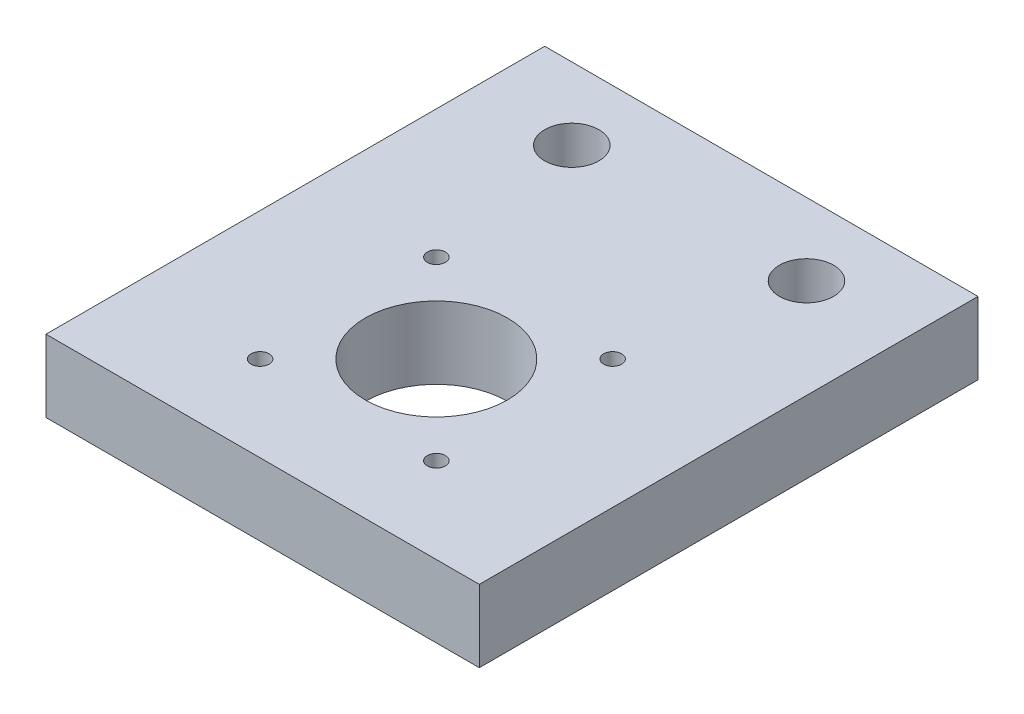
ISO-10303-21;
HEADER;
FILE_DESCRIPTION(('STEP AP214'),'2;1');
FILE_NAME('part.step','',(''),(''),'','','');
FILE_SCHEMA(('AUTOMOTIVE_DESIGN { 1 0 10303 214 1 1 1 1 }'));
ENDSEC;
DATA;
#1=APPLICATION_CONTEXT('core data for automotive mechanical design processes');
#2=APPLICATION_PROTOCOL_DEFINITION('international standard','automotive_design',2000,#1);
#3=PRODUCT_CONTEXT('',#1,'mechanical');
#4=PRODUCT('Part','Part','',(#3));
#5=PRODUCT_RELATED_PRODUCT_CATEGORY('part','',(#4));
#6=PRODUCT_DEFINITION_FORMATION('','',#4);
#7=PRODUCT_DEFINITION_CONTEXT('part definition',#1,'design');
#8=PRODUCT_DEFINITION('design','',#6,#7);
#9=PRODUCT_DEFINITION_SHAPE('','',#8);
#10=(LENGTH_UNIT() NAMED_UNIT(*) SI_UNIT(.MILLI.,.METRE.));
#11=(NAMED_UNIT(*) PLANE_ANGLE_UNIT() SI_UNIT($,.RADIAN.));
#12=(NAMED_UNIT(*) SI_UNIT($,.STERADIAN.) SOLID_ANGLE_UNIT());
#13=UNCERTAINTY_MEASURE_WITH_UNIT(LENGTH_MEASURE(1.E-05),#10,'distance_accuracy_value','');
#14=(GEOMETRIC_REPRESENTATION_CONTEXT(3) GLOBAL_UNCERTAINTY_ASSIGNED_CONTEXT((#13)) GLOBAL_UNIT_ASSIGNED_CONTEXT((#10,
#11,#12)) REPRESENTATION_CONTEXT('',''));
#15=CARTESIAN_POINT('',(0.,0.,0.));
#16=DIRECTION('',(0.,0.,1.));
#17=DIRECTION('',(1.,0.,0.));
#18=AXIS2_PLACEMENT_3D('',#15,#16,#17);
#19=CARTESIAN_POINT('',(-17.4625,12.7,-12.7));
#20=DIRECTION('',(0.,-1.,0.));
#21=DIRECTION('',(0.,0.,-1.));
#22=AXIS2_PLACEMENT_3D('',#19,#20,#21);
#23=PLANE('',#22);
#24=CARTESIAN_POINT('',(5.13750000000033,12.7,59.9500000000002));
#25=DIRECTION('',(0.,1.,0.));
#26=DIRECTION('',(0.,0.,1.));
#27=AXIS2_PLACEMENT_3D('',#24,#25,#26);
#28=CIRCLE('',#27,1.5875);
#29=CARTESIAN_POINT('',(5.13750000000033,12.7,61.5375000000002));
#30=VERTEX_POINT('',#29);
#31=EDGE_CURVE('E146',#30,#30,#28,.T.);
#32=ORIENTED_EDGE('',*,*,#31,.F.);
#33=EDGE_LOOP('',(#32));
#34=FACE_BOUND('',#33,.T.);
#35=CARTESIAN_POINT('',(36.1375000000003,12.7,59.95));
#36=DIRECTION('',(0.,1.,0.));
#37=DIRECTION('',(0.,0.,1.));
#38=AXIS2_PLACEMENT_3D('',#35,#36,#37);
#39=CIRCLE('',#38,1.5875);
#40=CARTESIAN_POINT('',(36.1375000000003,12.7,61.5375));
#41=VERTEX_POINT('',#40);
#42=EDGE_CURVE('E140',#41,#41,#39,.T.);
#43=ORIENTED_EDGE('',*,*,#42,.F.);
#44=EDGE_LOOP('',(#43));
#45=FACE_BOUND('',#44,.T.);
#46=CARTESIAN_POINT('',(5.1375,12.7,28.9500000000002));
#47=DIRECTION('',(0.,1.,0.));
#48=DIRECTION('',(0.,0.,1.));
#49=AXIS2_PLACEMENT_3D('',#46,#47,#48);
#50=CIRCLE('',#49,1.5875);
#51=CARTESIAN_POINT('',(5.1375,12.7,30.5375000000002));
#52=VERTEX_POINT('',#51);
#53=EDGE_CURVE('E134',#52,#52,#50,.T.);
#54=ORIENTED_EDGE('',*,*,#53,.F.);
#55=EDGE_LOOP('',(#54));
#56=FACE_BOUND('',#55,.T.);
#57=CARTESIAN_POINT('',(36.1375,12.7,28.95));
#58=DIRECTION('',(0.,1.,0.));
#59=DIRECTION('',(0.,0.,1.));
#60=AXIS2_PLACEMENT_3D('',#57,#58,#59);
#61=CIRCLE('',#60,1.5875);
#62=CARTESIAN_POINT('',(36.1375,12.7,30.5375));
#63=VERTEX_POINT('',#62);
#64=EDGE_CURVE('E128',#63,#63,#61,.T.);
#65=ORIENTED_EDGE('',*,*,#64,.F.);
#66=EDGE_LOOP('',(#65));
#67=FACE_BOUND('',#66,.T.);
#68=CARTESIAN_POINT('',(20.6375,12.7,44.45));
#69=DIRECTION('',(0.,1.,0.));
#70=DIRECTION('',(0.,0.,1.));
#71=AXIS2_PLACEMENT_3D('',#68,#69,#70);
#72=CIRCLE('',#71,12.5);
#73=CARTESIAN_POINT('',(20.6375,12.7,56.95));
#74=VERTEX_POINT('',#73);
#75=EDGE_CURVE('E122',#74,#74,#72,.T.);
#76=ORIENTED_EDGE('',*,*,#75,.F.);
#77=EDGE_LOOP('',(#76));
#78=FACE_BOUND('',#77,.T.);
#79=CARTESIAN_POINT('',(0.,12.7,0.));
#80=DIRECTION('',(0.,1.,0.));
#81=DIRECTION('',(0.,0.,1.));
#82=AXIS2_PLACEMENT_3D('',#79,#80,#81);
#83=CIRCLE('',#82,4.7625);
#84=CARTESIAN_POINT('',(0.,12.7,4.7625));
#85=VERTEX_POINT('',#84);
#86=EDGE_CURVE('E98',#85,#85,#83,.T.);
#87=ORIENTED_EDGE('',*,*,#86,.F.);
#88=EDGE_LOOP('',(#87));
#89=FACE_BOUND('',#88,.T.);
#90=DIRECTION('',(0.,0.,1.));
#91=VECTOR('',#90,1.);
#92=CARTESIAN_POINT('',(-17.4625,12.7,75.));
#93=LINE('',#92,#91);
#94=CARTESIAN_POINT('',(-17.4625,12.7,-12.7));
#95=VERTEX_POINT('',#94);
#96=CARTESIAN_POINT('',(-17.4625,12.7,75.));
#97=VERTEX_POINT('',#96);
#98=EDGE_CURVE('E83',#95,#97,#93,.T.);
#99=ORIENTED_EDGE('',*,*,#98,.T.);
#100=DIRECTION('',(1.,0.,0.));
#101=VECTOR('',#100,1.);
#102=CARTESIAN_POINT('',(58.7375,12.7,75.));
#103=LINE('',#102,#101);
#104=CARTESIAN_POINT('',(58.7375,12.7,75.));
#105=VERTEX_POINT('',#104);
#106=EDGE_CURVE('E78',#97,#105,#103,.T.);
#107=ORIENTED_EDGE('',*,*,#106,.T.);
#108=DIRECTION('',(0.,0.,-1.));
#109=VECTOR('',#108,1.);
#110=CARTESIAN_POINT('',(58.7375,12.7,-12.7));
#111=LINE('',#110,#109);
#112=CARTESIAN_POINT('',(58.7375,12.7,-12.7));
#113=VERTEX_POINT('',#112);
#114=EDGE_CURVE('E81',#105,#113,#111,.T.);
#115=ORIENTED_EDGE('',*,*,#114,.T.);
#116=DIRECTION('',(-1.,0.,0.));
#117=VECTOR('',#116,1.);
#118=CARTESIAN_POINT('',(-17.4625,12.7,-12.7));
#119=LINE('',#118,#117);
#120=EDGE_CURVE('E48',#113,#95,#119,.T.);
#121=ORIENTED_EDGE('',*,*,#120,.T.);
#122=EDGE_LOOP('',(#99,#107,#115,#121));
#123=FACE_BOUND('',#122,.T.);
#124=CARTESIAN_POINT('',(41.275,12.7,0.));
#125=DIRECTION('',(0.,1.,0.));
#126=DIRECTION('',(0.,0.,1.));
#127=AXIS2_PLACEMENT_3D('',#124,#125,#126);
#128=CIRCLE('',#127,4.7625);
#129=CARTESIAN_POINT('',(41.275,12.7,4.7625));
#130=VERTEX_POINT('',#129);
#131=EDGE_CURVE('E113',#130,#130,#128,.T.);
#132=ORIENTED_EDGE('',*,*,#131,.F.);
#133=EDGE_LOOP('',(#132));
#134=FACE_BOUND('',#133,.T.);
#135=ADVANCED_FACE('F31',(#34,#45,#56,#67,#78,#89,#123,#134),#23,.F.);
#136=CARTESIAN_POINT('',(-17.4625,0.,-12.7));
#137=DIRECTION('',(0.,-1.,0.));
#138=DIRECTION('',(0.,0.,-1.));
#139=AXIS2_PLACEMENT_3D('',#136,#137,#138);
#140=PLANE('',#139);
#141=CARTESIAN_POINT('',(5.13750000000033,0.,59.9500000000002));
#142=DIRECTION('',(0.,1.,0.));
#143=DIRECTION('',(0.,0.,1.));
#144=AXIS2_PLACEMENT_3D('',#141,#142,#143);
#145=CIRCLE('',#144,1.5875);
#146=CARTESIAN_POINT('',(5.13750000000033,0.,61.5375000000002));
#147=VERTEX_POINT('',#146);
#148=EDGE_CURVE('E143',#147,#147,#145,.T.);
#149=ORIENTED_EDGE('',*,*,#148,.T.);
#150=EDGE_LOOP('',(#149));
#151=FACE_BOUND('',#150,.T.);
#152=CARTESIAN_POINT('',(36.1375000000003,0.,59.95));
#153=DIRECTION('',(0.,1.,0.));
#154=DIRECTION('',(0.,0.,1.));
#155=AXIS2_PLACEMENT_3D('',#152,#153,#154);
#156=CIRCLE('',#155,1.5875);
#157=CARTESIAN_POINT('',(36.1375000000003,0.,61.5375));
#158=VERTEX_POINT('',#157);
#159=EDGE_CURVE('E137',#158,#158,#156,.T.);
#160=ORIENTED_EDGE('',*,*,#159,.T.);
#161=EDGE_LOOP('',(#160));
#162=FACE_BOUND('',#161,.T.);
#163=CARTESIAN_POINT('',(5.1375,0.,28.9500000000002));
#164=DIRECTION('',(0.,1.,0.));
#165=DIRECTION('',(0.,0.,1.));
#166=AXIS2_PLACEMENT_3D('',#163,#164,#165);
#167=CIRCLE('',#166,1.5875);
#168=CARTESIAN_POINT('',(5.1375,0.,30.5375000000002));
#169=VERTEX_POINT('',#168);
#170=EDGE_CURVE('E131',#169,#169,#167,.T.);
#171=ORIENTED_EDGE('',*,*,#170,.T.);
#172=EDGE_LOOP('',(#171));
#173=FACE_BOUND('',#172,.T.);
#174=CARTESIAN_POINT('',(36.1375,0.,28.95));
#175=DIRECTION('',(0.,1.,0.));
#176=DIRECTION('',(0.,0.,1.));
#177=AXIS2_PLACEMENT_3D('',#174,#175,#176);
#178=CIRCLE('',#177,1.5875);
#179=CARTESIAN_POINT('',(36.1375,0.,30.5375));
#180=VERTEX_POINT('',#179);
#181=EDGE_CURVE('E125',#180,#180,#178,.T.);
#182=ORIENTED_EDGE('',*,*,#181,.T.);
#183=EDGE_LOOP('',(#182));
#184=FACE_BOUND('',#183,.T.);
#185=CARTESIAN_POINT('',(20.6375,0.,44.45));
#186=DIRECTION('',(0.,1.,0.));
#187=DIRECTION('',(0.,0.,1.));
#188=AXIS2_PLACEMENT_3D('',#185,#186,#187);
#189=CIRCLE('',#188,12.5);
#190=CARTESIAN_POINT('',(20.6375,0.,56.95));
#191=VERTEX_POINT('',#190);
#192=EDGE_CURVE('E119',#191,#191,#189,.T.);
#193=ORIENTED_EDGE('',*,*,#192,.T.);
#194=EDGE_LOOP('',(#193));
#195=FACE_BOUND('',#194,.T.);
#196=CARTESIAN_POINT('',(0.,0.,0.));
#197=DIRECTION('',(0.,1.,0.));
#198=DIRECTION('',(0.,0.,1.));
#199=AXIS2_PLACEMENT_3D('',#196,#197,#198);
#200=CIRCLE('',#199,4.7625);
#201=CARTESIAN_POINT('',(0.,0.,4.7625));
#202=VERTEX_POINT('',#201);
#203=EDGE_CURVE('E110',#202,#202,#200,.T.);
#204=ORIENTED_EDGE('',*,*,#203,.T.);
#205=EDGE_LOOP('',(#204));
#206=FACE_BOUND('',#205,.T.);
#207=DIRECTION('',(0.,0.,1.));
#208=VECTOR('',#207,1.);
#209=CARTESIAN_POINT('',(-17.4625,0.,75.));
#210=LINE('',#209,#208);
#211=CARTESIAN_POINT('',(-17.4625,0.,-12.7));
#212=VERTEX_POINT('',#211);
#213=CARTESIAN_POINT('',(-17.4625,0.,75.));
#214=VERTEX_POINT('',#213);
#215=EDGE_CURVE('E95',#212,#214,#210,.T.);
#216=ORIENTED_EDGE('',*,*,#215,.F.);
#217=DIRECTION('',(-1.,0.,0.));
#218=VECTOR('',#217,1.);
#219=CARTESIAN_POINT('',(-17.4625,0.,-12.7));
#220=LINE('',#219,#218);
#221=CARTESIAN_POINT('',(58.7375,0.,-12.7));
#222=VERTEX_POINT('',#221);
#223=EDGE_CURVE('E71',#222,#212,#220,.T.);
#224=ORIENTED_EDGE('',*,*,#223,.F.);
#225=DIRECTION('',(0.,0.,-1.));
#226=VECTOR('',#225,1.);
#227=CARTESIAN_POINT('',(58.7375,0.,-12.7));
#228=LINE('',#227,#226);
#229=CARTESIAN_POINT('',(58.7375,0.,75.));
#230=VERTEX_POINT('',#229);
#231=EDGE_CURVE('E65',#230,#222,#228,.T.);
#232=ORIENTED_EDGE('',*,*,#231,.F.);
#233=DIRECTION('',(1.,0.,0.));
#234=VECTOR('',#233,1.);
#235=CARTESIAN_POINT('',(58.7375,0.,75.));
#236=LINE('',#235,#234);
#237=EDGE_CURVE('E87',#214,#230,#236,.T.);
#238=ORIENTED_EDGE('',*,*,#237,.F.);
#239=EDGE_LOOP('',(#216,#224,#232,#238));
#240=FACE_BOUND('',#239,.T.);
#241=CARTESIAN_POINT('',(41.275,0.,0.));
#242=DIRECTION('',(0.,1.,0.));
#243=DIRECTION('',(0.,0.,1.));
#244=AXIS2_PLACEMENT_3D('',#241,#242,#243);
#245=CIRCLE('',#244,4.7625);
#246=CARTESIAN_POINT('',(41.275,0.,4.7625));
#247=VERTEX_POINT('',#246);
#248=EDGE_CURVE('E116',#247,#247,#245,.T.);
#249=ORIENTED_EDGE('',*,*,#248,.T.);
#250=EDGE_LOOP('',(#249));
#251=FACE_BOUND('',#250,.T.);
#252=ADVANCED_FACE('F106',(#151,#162,#173,#184,#195,#206,#240,#251),#140,.T.);
#253=CARTESIAN_POINT('',(-17.4625,12.7,75.));
#254=DIRECTION('',(1.,0.,0.));
#255=DIRECTION('',(0.,0.,-1.));
#256=AXIS2_PLACEMENT_3D('',#253,#254,#255);
#257=PLANE('',#256);
#258=ORIENTED_EDGE('',*,*,#215,.T.);
#259=DIRECTION('',(0.,-1.,0.));
#260=VECTOR('',#259,1.);
#261=CARTESIAN_POINT('',(-17.4625,12.7,75.));
#262=LINE('',#261,#260);
#263=EDGE_CURVE('E11',#97,#214,#262,.T.);
#264=ORIENTED_EDGE('',*,*,#263,.F.);
#265=ORIENTED_EDGE('',*,*,#98,.F.);
#266=DIRECTION('',(0.,-1.,0.));
#267=VECTOR('',#266,1.);
#268=CARTESIAN_POINT('',(-17.4625,12.7,-12.7));
#269=LINE('',#268,#267);
#270=EDGE_CURVE('E91',#95,#212,#269,.T.);
#271=ORIENTED_EDGE('',*,*,#270,.T.);
#272=EDGE_LOOP('',(#258,#264,#265,#271));
#273=FACE_BOUND('',#272,.T.);
#274=ADVANCED_FACE('F33',(#273),#257,.F.);
#275=CARTESIAN_POINT('',(58.7375,12.7,75.));
#276=DIRECTION('',(0.,0.,-1.));
#277=DIRECTION('',(-1.,0.,0.));
#278=AXIS2_PLACEMENT_3D('',#275,#276,#277);
#279=PLANE('',#278);
#280=ORIENTED_EDGE('',*,*,#237,.T.);
#281=DIRECTION('',(0.,-1.,0.));
#282=VECTOR('',#281,1.);
#283=CARTESIAN_POINT('',(58.7375,12.7,75.));
#284=LINE('',#283,#282);
#285=EDGE_CURVE('E40',#105,#230,#284,.T.);
#286=ORIENTED_EDGE('',*,*,#285,.F.);
#287=ORIENTED_EDGE('',*,*,#106,.F.);
#288=ORIENTED_EDGE('',*,*,#263,.T.);
#289=EDGE_LOOP('',(#280,#286,#287,#288));
#290=FACE_BOUND('',#289,.T.);
#291=ADVANCED_FACE('F86',(#290),#279,.F.);
#292=CARTESIAN_POINT('',(58.7375,12.7,-12.7));
#293=DIRECTION('',(-1.,0.,0.));
#294=DIRECTION('',(0.,0.,1.));
#295=AXIS2_PLACEMENT_3D('',#292,#293,#294);
#296=PLANE('',#295);
#297=ORIENTED_EDGE('',*,*,#231,.T.);
#298=DIRECTION('',(0.,-1.,0.));
#299=VECTOR('',#298,1.);
#300=CARTESIAN_POINT('',(58.7375,12.7,-12.7));
#301=LINE('',#300,#299);
#302=EDGE_CURVE('E88',#113,#222,#301,.T.);
#303=ORIENTED_EDGE('',*,*,#302,.F.);
#304=ORIENTED_EDGE('',*,*,#114,.F.);
#305=ORIENTED_EDGE('',*,*,#285,.T.);
#306=EDGE_LOOP('',(#297,#303,#304,#305));
#307=FACE_BOUND('',#306,.T.);
#308=ADVANCED_FACE('F89',(#307),#296,.F.);
#309=CARTESIAN_POINT('',(-17.4625,12.7,-12.7));
#310=DIRECTION('',(0.,0.,1.));
#311=DIRECTION('',(1.,0.,0.));
#312=AXIS2_PLACEMENT_3D('',#309,#310,#311);
#313=PLANE('',#312);
#314=ORIENTED_EDGE('',*,*,#223,.T.);
#315=ORIENTED_EDGE('',*,*,#270,.F.);
#316=ORIENTED_EDGE('',*,*,#120,.F.);
#317=ORIENTED_EDGE('',*,*,#302,.T.);
#318=EDGE_LOOP('',(#314,#315,#316,#317));
#319=FACE_BOUND('',#318,.T.);
#320=ADVANCED_FACE('F103',(#319),#313,.F.);
#321=CARTESIAN_POINT('',(0.,12.7,0.));
#322=DIRECTION('',(0.,-1.,0.));
#323=DIRECTION('',(0.,0.,-1.));
#324=AXIS2_PLACEMENT_3D('',#321,#322,#323);
#325=CYLINDRICAL_SURFACE('',#324,4.7625);
#326=ORIENTED_EDGE('',*,*,#86,.T.);
#327=EDGE_LOOP('',(#326));
#328=FACE_BOUND('',#327,.T.);
#329=ORIENTED_EDGE('',*,*,#203,.F.);
#330=EDGE_LOOP('',(#329));
#331=FACE_BOUND('',#330,.T.);
#332=ADVANCED_FACE('F174',(#328,#331),#325,.F.);
#333=CARTESIAN_POINT('',(41.275,12.7,0.));
#334=DIRECTION('',(0.,-1.,0.));
#335=DIRECTION('',(0.,0.,-1.));
#336=AXIS2_PLACEMENT_3D('',#333,#334,#335);
#337=CYLINDRICAL_SURFACE('',#336,4.7625);
#338=ORIENTED_EDGE('',*,*,#131,.T.);
#339=EDGE_LOOP('',(#338));
#340=FACE_BOUND('',#339,.T.);
#341=ORIENTED_EDGE('',*,*,#248,.F.);
#342=EDGE_LOOP('',(#341));
#343=FACE_BOUND('',#342,.T.);
#344=ADVANCED_FACE('F177',(#340,#343),#337,.F.);
#345=CARTESIAN_POINT('',(20.6375,0.,44.45));
#346=DIRECTION('',(0.,1.,0.));
#347=DIRECTION('',(0.,0.,1.));
#348=AXIS2_PLACEMENT_3D('',#345,#346,#347);
#349=CYLINDRICAL_SURFACE('',#348,12.5);
#350=ORIENTED_EDGE('',*,*,#192,.F.);
#351=EDGE_LOOP('',(#350));
#352=FACE_BOUND('',#351,.T.);
#353=ORIENTED_EDGE('',*,*,#75,.T.);
#354=EDGE_LOOP('',(#353));
#355=FACE_BOUND('',#354,.T.);
#356=ADVANCED_FACE('F213',(#352,#355),#349,.F.);
#357=CARTESIAN_POINT('',(36.1375,0.,28.95));
#358=DIRECTION('',(0.,1.,0.));
#359=DIRECTION('',(0.,0.,1.));
#360=AXIS2_PLACEMENT_3D('',#357,#358,#359);
#361=CYLINDRICAL_SURFACE('',#360,1.5875);
#362=ORIENTED_EDGE('',*,*,#181,.F.);
#363=EDGE_LOOP('',(#362));
#364=FACE_BOUND('',#363,.T.);
#365=ORIENTED_EDGE('',*,*,#64,.T.);
#366=EDGE_LOOP('',(#365));
#367=FACE_BOUND('',#366,.T.);
#368=ADVANCED_FACE('F222',(#364,#367),#361,.F.);
#369=CARTESIAN_POINT('',(5.1375,0.,28.9500000000002));
#370=DIRECTION('',(0.,1.,0.));
#371=DIRECTION('',(0.,0.,1.));
#372=AXIS2_PLACEMENT_3D('',#369,#370,#371);
#373=CYLINDRICAL_SURFACE('',#372,1.5875);
#374=ORIENTED_EDGE('',*,*,#170,.F.);
#375=EDGE_LOOP('',(#374));
#376=FACE_BOUND('',#375,.T.);
#377=ORIENTED_EDGE('',*,*,#53,.T.);
#378=EDGE_LOOP('',(#377));
#379=FACE_BOUND('',#378,.T.);
#380=ADVANCED_FACE('F230',(#376,#379),#373,.F.);
#381=CARTESIAN_POINT('',(36.1375000000003,0.,59.95));
#382=DIRECTION('',(0.,1.,0.));
#383=DIRECTION('',(0.,0.,1.));
#384=AXIS2_PLACEMENT_3D('',#381,#382,#383);
#385=CYLINDRICAL_SURFACE('',#384,1.5875);
#386=ORIENTED_EDGE('',*,*,#159,.F.);
#387=EDGE_LOOP('',(#386));
#388=FACE_BOUND('',#387,.T.);
#389=ORIENTED_EDGE('',*,*,#42,.T.);
#390=EDGE_LOOP('',(#389));
#391=FACE_BOUND('',#390,.T.);
#392=ADVANCED_FACE('F157',(#388,#391),#385,.F.);
#393=CARTESIAN_POINT('',(5.13750000000033,0.,59.9500000000002));
#394=DIRECTION('',(0.,1.,0.));
#395=DIRECTION('',(0.,0.,1.));
#396=AXIS2_PLACEMENT_3D('',#393,#394,#395);
#397=CYLINDRICAL_SURFACE('',#396,1.5875);
#398=ORIENTED_EDGE('',*,*,#148,.F.);
#399=EDGE_LOOP('',(#398));
#400=FACE_BOUND('',#399,.T.);
#401=ORIENTED_EDGE('',*,*,#31,.T.);
#402=EDGE_LOOP('',(#401));
#403=FACE_BOUND('',#402,.T.);
#404=ADVANCED_FACE('F154',(#400,#403),#397,.F.);
#405=CLOSED_SHELL('',(#135,#252,#274,#291,#308,#320,#332,#344,#356,#368,#380,#392,#404));
#406=MANIFOLD_SOLID_BREP('B2',#405);
#407=ADVANCED_BREP_SHAPE_REPRESENTATION('',(#18,#406),#14);
#408=SHAPE_DEFINITION_REPRESENTATION(#9,#407);
ENDSEC;
END-ISO-10303-21;
